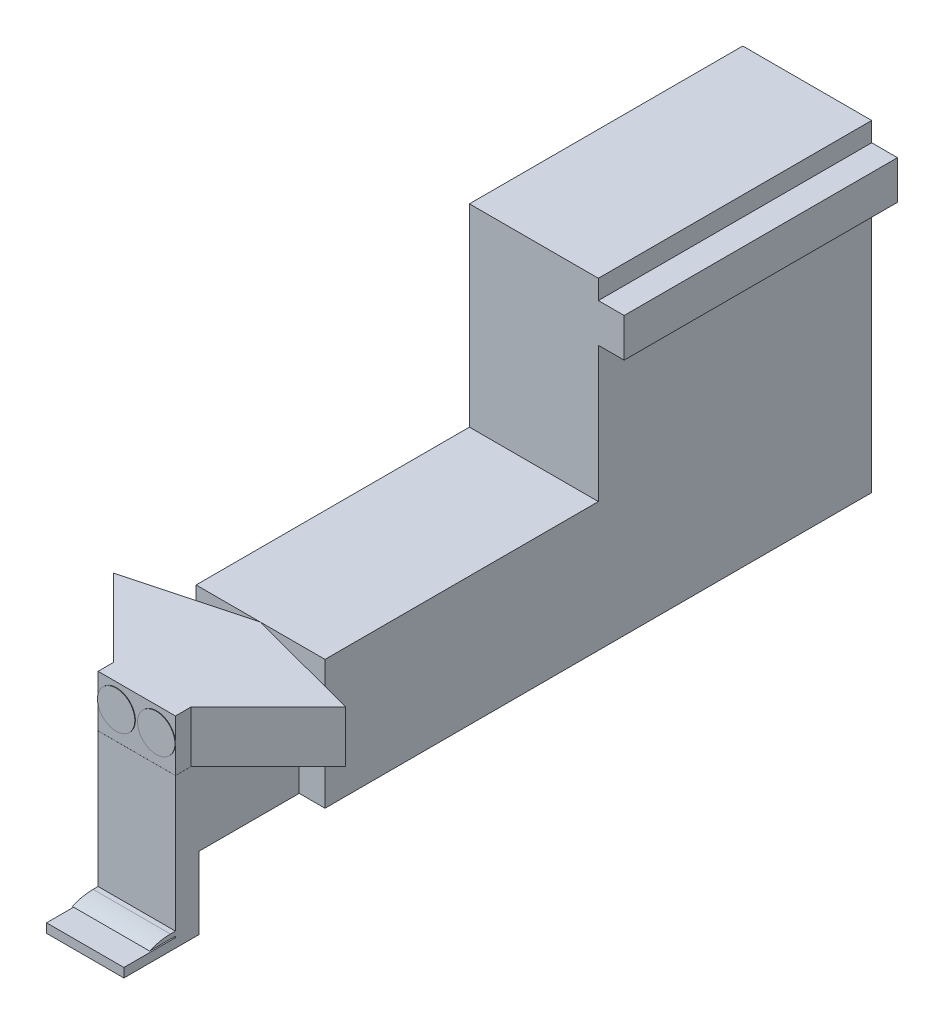
ISO-10303-21;
HEADER;
FILE_DESCRIPTION(('STEP AP214'),'2;1');
FILE_NAME('part.step','',(''),(''),'','','');
FILE_SCHEMA(('AUTOMOTIVE_DESIGN { 1 0 10303 214 1 1 1 1 }'));
ENDSEC;
DATA;
#1=APPLICATION_CONTEXT('core data for automotive mechanical design processes');
#2=APPLICATION_PROTOCOL_DEFINITION('international standard','automotive_design',2000,#1);
#3=PRODUCT_CONTEXT('',#1,'mechanical');
#4=PRODUCT('Part','Part','',(#3));
#5=PRODUCT_RELATED_PRODUCT_CATEGORY('part','',(#4));
#6=PRODUCT_DEFINITION_FORMATION('','',#4);
#7=PRODUCT_DEFINITION_CONTEXT('part definition',#1,'design');
#8=PRODUCT_DEFINITION('design','',#6,#7);
#9=PRODUCT_DEFINITION_SHAPE('','',#8);
#10=(LENGTH_UNIT() NAMED_UNIT(*) SI_UNIT(.MILLI.,.METRE.));
#11=(NAMED_UNIT(*) PLANE_ANGLE_UNIT() SI_UNIT($,.RADIAN.));
#12=(NAMED_UNIT(*) SI_UNIT($,.STERADIAN.) SOLID_ANGLE_UNIT());
#13=UNCERTAINTY_MEASURE_WITH_UNIT(LENGTH_MEASURE(1.E-05),#10,'distance_accuracy_value','');
#14=(GEOMETRIC_REPRESENTATION_CONTEXT(3) GLOBAL_UNCERTAINTY_ASSIGNED_CONTEXT((#13)) GLOBAL_UNIT_ASSIGNED_CONTEXT((#10,
#11,#12)) REPRESENTATION_CONTEXT('',''));
#15=CARTESIAN_POINT('',(0.,0.,0.));
#16=DIRECTION('',(0.,0.,1.));
#17=DIRECTION('',(1.,0.,0.));
#18=AXIS2_PLACEMENT_3D('',#15,#16,#17);
#19=CARTESIAN_POINT('',(-12.5,-40.,79.5));
#20=DIRECTION('',(0.257662650560333,0.,-0.966234939601246));
#21=DIRECTION('',(-0.966234939601246,0.,-0.257662650560333));
#22=AXIS2_PLACEMENT_3D('',#19,#20,#21);
#23=PLANE('',#22);
#24=DIRECTION('',(-0.966234939601246,0.,-0.257662650560333));
#25=VECTOR('',#24,1.);
#26=CARTESIAN_POINT('',(-12.5,-30.,79.5));
#27=LINE('',#26,#25);
#28=CARTESIAN_POINT('',(10.,-30.,85.5));
#29=VERTEX_POINT('',#28);
#30=CARTESIAN_POINT('',(-12.5,-30.,79.5));
#31=VERTEX_POINT('',#30);
#32=EDGE_CURVE('E156',#29,#31,#27,.T.);
#33=ORIENTED_EDGE('',*,*,#32,.F.);
#34=DIRECTION('',(0.,1.,0.));
#35=VECTOR('',#34,1.);
#36=CARTESIAN_POINT('',(10.,-40.,85.5));
#37=LINE('',#36,#35);
#38=CARTESIAN_POINT('',(10.,-40.,85.5));
#39=VERTEX_POINT('',#38);
#40=EDGE_CURVE('E61',#39,#29,#37,.T.);
#41=ORIENTED_EDGE('',*,*,#40,.F.);
#42=DIRECTION('',(-0.966234939601246,0.,-0.257662650560333));
#43=VECTOR('',#42,1.);
#44=CARTESIAN_POINT('',(-12.5,-40.,79.5));
#45=LINE('',#44,#43);
#46=CARTESIAN_POINT('',(-12.5,-40.,79.5));
#47=VERTEX_POINT('',#46);
#48=EDGE_CURVE('E178',#39,#47,#45,.T.);
#49=ORIENTED_EDGE('',*,*,#48,.T.);
#50=DIRECTION('',(0.,1.,0.));
#51=VECTOR('',#50,1.);
#52=CARTESIAN_POINT('',(-12.5,-40.,79.5));
#53=LINE('',#52,#51);
#54=EDGE_CURVE('E56',#47,#31,#53,.T.);
#55=ORIENTED_EDGE('',*,*,#54,.T.);
#56=EDGE_LOOP('',(#33,#41,#49,#55));
#57=FACE_BOUND('',#56,.T.);
#58=ADVANCED_FACE('F53',(#57),#23,.T.);
#59=CARTESIAN_POINT('',(10.,-40.,85.5));
#60=DIRECTION('',(0.707106781186549,0.,0.707106781186546));
#61=DIRECTION('',(0.707106781186546,0.,-0.707106781186549));
#62=AXIS2_PLACEMENT_3D('',#59,#60,#61);
#63=PLANE('',#62);
#64=DIRECTION('',(0.707106781186546,0.,-0.707106781186549));
#65=VECTOR('',#64,1.);
#66=CARTESIAN_POINT('',(10.,-30.,85.5));
#67=LINE('',#66,#65);
#68=CARTESIAN_POINT('',(-4.99999999999994,-30.,100.5));
#69=VERTEX_POINT('',#68);
#70=EDGE_CURVE('E175',#69,#29,#67,.T.);
#71=ORIENTED_EDGE('',*,*,#70,.F.);
#72=DIRECTION('',(0.,1.,0.));
#73=VECTOR('',#72,1.);
#74=CARTESIAN_POINT('',(-4.99999999999994,-40.,100.5));
#75=LINE('',#74,#73);
#76=CARTESIAN_POINT('',(-4.99999999999994,-40.,100.5));
#77=VERTEX_POINT('',#76);
#78=EDGE_CURVE('E137',#77,#69,#75,.T.);
#79=ORIENTED_EDGE('',*,*,#78,.F.);
#80=DIRECTION('',(0.707106781186546,0.,-0.707106781186549));
#81=VECTOR('',#80,1.);
#82=CARTESIAN_POINT('',(10.,-40.,85.5));
#83=LINE('',#82,#81);
#84=EDGE_CURVE('E145',#77,#39,#83,.T.);
#85=ORIENTED_EDGE('',*,*,#84,.T.);
#86=ORIENTED_EDGE('',*,*,#40,.T.);
#87=EDGE_LOOP('',(#71,#79,#85,#86));
#88=FACE_BOUND('',#87,.T.);
#89=ADVANCED_FACE('F190',(#88),#63,.T.);
#90=CARTESIAN_POINT('',(-4.99999999999994,-40.,100.5));
#91=DIRECTION('',(1.,0.,0.));
#92=DIRECTION('',(0.,0.,-1.));
#93=AXIS2_PLACEMENT_3D('',#90,#91,#92);
#94=PLANE('',#93);
#95=DIRECTION('',(0.,0.,-1.));
#96=VECTOR('',#95,1.);
#97=CARTESIAN_POINT('',(-4.99999999999994,-30.,100.5));
#98=LINE('',#97,#96);
#99=CARTESIAN_POINT('',(-4.99999999999994,-30.,103.5));
#100=VERTEX_POINT('',#99);
#101=EDGE_CURVE('E172',#100,#69,#98,.T.);
#102=ORIENTED_EDGE('',*,*,#101,.F.);
#103=DIRECTION('',(0.,1.,0.));
#104=VECTOR('',#103,1.);
#105=CARTESIAN_POINT('',(-4.99999999999994,-40.,103.5));
#106=LINE('',#105,#104);
#107=CARTESIAN_POINT('',(-4.99999999999994,-34.5921520121428,103.5));
#108=VERTEX_POINT('',#107);
#109=EDGE_CURVE('E134',#108,#100,#106,.T.);
#110=ORIENTED_EDGE('',*,*,#109,.F.);
#111=CARTESIAN_POINT('',(-4.99999999999994,-40.,103.5));
#112=VERTEX_POINT('',#111);
#113=EDGE_CURVE('E127',#112,#108,#106,.T.);
#114=ORIENTED_EDGE('',*,*,#113,.F.);
#115=DIRECTION('',(0.,0.,-1.));
#116=VECTOR('',#115,1.);
#117=CARTESIAN_POINT('',(-4.99999999999994,-40.,100.5));
#118=LINE('',#117,#116);
#119=EDGE_CURVE('E131',#112,#77,#118,.T.);
#120=ORIENTED_EDGE('',*,*,#119,.T.);
#121=ORIENTED_EDGE('',*,*,#78,.T.);
#122=EDGE_LOOP('',(#102,#110,#114,#120,#121));
#123=FACE_BOUND('',#122,.T.);
#124=ADVANCED_FACE('F130',(#123),#94,.T.);
#125=CARTESIAN_POINT('',(-20.0000000000001,-40.,103.5));
#126=DIRECTION('',(0.,0.,1.));
#127=DIRECTION('',(1.,0.,0.));
#128=AXIS2_PLACEMENT_3D('',#125,#126,#127);
#129=PLANE('',#128);
#130=CARTESIAN_POINT('',(-16.3980165160289,-34.5921520121428,103.5));
#131=DIRECTION('',(0.,0.,1.));
#132=DIRECTION('',(1.,0.,0.));
#133=AXIS2_PLACEMENT_3D('',#130,#131,#132);
#134=CIRCLE('',#133,3.625);
#135=CARTESIAN_POINT('',(-20.0000000000001,-35.,103.5));
#136=VERTEX_POINT('',#135);
#137=CARTESIAN_POINT('',(-20.0000000000001,-34.1843040242856,103.5));
#138=VERTEX_POINT('',#137);
#139=EDGE_CURVE('E12',#136,#138,#134,.T.);
#140=ORIENTED_EDGE('',*,*,#139,.F.);
#141=DIRECTION('',(0.,1.,0.));
#142=VECTOR('',#141,1.);
#143=CARTESIAN_POINT('',(-20.0000000000001,-40.,103.5));
#144=LINE('',#143,#142);
#145=CARTESIAN_POINT('',(-20.0000000000001,-40.,103.5));
#146=VERTEX_POINT('',#145);
#147=EDGE_CURVE('E148',#146,#136,#144,.T.);
#148=ORIENTED_EDGE('',*,*,#147,.F.);
#149=DIRECTION('',(1.,0.,0.));
#150=VECTOR('',#149,1.);
#151=CARTESIAN_POINT('',(-20.0000000000001,-40.,103.5));
#152=LINE('',#151,#150);
#153=EDGE_CURVE('E143',#146,#112,#152,.T.);
#154=ORIENTED_EDGE('',*,*,#153,.T.);
#155=ORIENTED_EDGE('',*,*,#113,.T.);
#156=CARTESIAN_POINT('',(-8.62499999999994,-34.5921520121428,103.5));
#157=DIRECTION('',(0.,0.,1.));
#158=DIRECTION('',(1.,0.,0.));
#159=AXIS2_PLACEMENT_3D('',#156,#157,#158);
#160=CIRCLE('',#159,3.625);
#161=EDGE_CURVE('E194',#108,#108,#160,.T.);
#162=ORIENTED_EDGE('',*,*,#161,.F.);
#163=ORIENTED_EDGE('',*,*,#109,.T.);
#164=DIRECTION('',(1.,0.,0.));
#165=VECTOR('',#164,1.);
#166=CARTESIAN_POINT('',(-20.0000000000001,-30.,103.5));
#167=LINE('',#166,#165);
#168=CARTESIAN_POINT('',(-20.0000000000001,-30.,103.5));
#169=VERTEX_POINT('',#168);
#170=EDGE_CURVE('E169',#169,#100,#167,.T.);
#171=ORIENTED_EDGE('',*,*,#170,.F.);
#172=EDGE_CURVE('E183',#138,#169,#144,.T.);
#173=ORIENTED_EDGE('',*,*,#172,.F.);
#174=EDGE_LOOP('',(#140,#148,#154,#155,#162,#163,#171,#173));
#175=FACE_BOUND('',#174,.T.);
#176=ADVANCED_FACE('F147',(#175),#129,.T.);
#177=CARTESIAN_POINT('',(-20.0000000000001,-40.,100.5));
#178=DIRECTION('',(-1.,0.,0.));
#179=DIRECTION('',(0.,0.,1.));
#180=AXIS2_PLACEMENT_3D('',#177,#178,#179);
#181=PLANE('',#180);
#182=DIRECTION('',(0.,0.,1.));
#183=VECTOR('',#182,1.);
#184=CARTESIAN_POINT('',(-20.0000000000001,-30.,100.5));
#185=LINE('',#184,#183);
#186=CARTESIAN_POINT('',(-20.0000000000001,-30.,100.5));
#187=VERTEX_POINT('',#186);
#188=EDGE_CURVE('E166',#187,#169,#185,.T.);
#189=ORIENTED_EDGE('',*,*,#188,.F.);
#190=DIRECTION('',(0.,1.,0.));
#191=VECTOR('',#190,1.);
#192=CARTESIAN_POINT('',(-20.0000000000001,-40.,100.5));
#193=LINE('',#192,#191);
#194=CARTESIAN_POINT('',(-20.0000000000001,-40.,100.5));
#195=VERTEX_POINT('',#194);
#196=EDGE_CURVE('E184',#195,#187,#193,.T.);
#197=ORIENTED_EDGE('',*,*,#196,.F.);
#198=DIRECTION('',(0.,0.,1.));
#199=VECTOR('',#198,1.);
#200=CARTESIAN_POINT('',(-20.0000000000001,-40.,100.5));
#201=LINE('',#200,#199);
#202=EDGE_CURVE('E149',#195,#146,#201,.T.);
#203=ORIENTED_EDGE('',*,*,#202,.T.);
#204=ORIENTED_EDGE('',*,*,#147,.T.);
#205=EDGE_CURVE('E182',#136,#138,#144,.T.);
#206=ORIENTED_EDGE('',*,*,#205,.T.);
#207=ORIENTED_EDGE('',*,*,#172,.T.);
#208=EDGE_LOOP('',(#189,#197,#203,#204,#206,#207));
#209=FACE_BOUND('',#208,.T.);
#210=ADVANCED_FACE('F208',(#209),#181,.T.);
#211=CARTESIAN_POINT('',(-35.,-40.,85.5));
#212=DIRECTION('',(-0.707106781186549,0.,0.707106781186546));
#213=DIRECTION('',(0.707106781186546,0.,0.707106781186549));
#214=AXIS2_PLACEMENT_3D('',#211,#212,#213);
#215=PLANE('',#214);
#216=DIRECTION('',(0.707106781186546,0.,0.707106781186549));
#217=VECTOR('',#216,1.);
#218=CARTESIAN_POINT('',(-35.,-30.,85.5));
#219=LINE('',#218,#217);
#220=CARTESIAN_POINT('',(-35.,-30.,85.5));
#221=VERTEX_POINT('',#220);
#222=EDGE_CURVE('E163',#221,#187,#219,.T.);
#223=ORIENTED_EDGE('',*,*,#222,.F.);
#224=DIRECTION('',(0.,1.,0.));
#225=VECTOR('',#224,1.);
#226=CARTESIAN_POINT('',(-35.,-40.,85.5));
#227=LINE('',#226,#225);
#228=CARTESIAN_POINT('',(-35.,-40.,85.5));
#229=VERTEX_POINT('',#228);
#230=EDGE_CURVE('E185',#229,#221,#227,.T.);
#231=ORIENTED_EDGE('',*,*,#230,.F.);
#232=DIRECTION('',(0.707106781186546,0.,0.707106781186549));
#233=VECTOR('',#232,1.);
#234=CARTESIAN_POINT('',(-35.,-40.,85.5));
#235=LINE('',#234,#233);
#236=EDGE_CURVE('E151',#229,#195,#235,.T.);
#237=ORIENTED_EDGE('',*,*,#236,.T.);
#238=ORIENTED_EDGE('',*,*,#196,.T.);
#239=EDGE_LOOP('',(#223,#231,#237,#238));
#240=FACE_BOUND('',#239,.T.);
#241=ADVANCED_FACE('F206',(#240),#215,.T.);
#242=CARTESIAN_POINT('',(-12.5,-40.,79.5));
#243=DIRECTION('',(-0.257662650560333,0.,-0.966234939601246));
#244=DIRECTION('',(-0.966234939601246,0.,0.257662650560333));
#245=AXIS2_PLACEMENT_3D('',#242,#243,#244);
#246=PLANE('',#245);
#247=DIRECTION('',(-0.966234939601246,0.,0.257662650560333));
#248=VECTOR('',#247,1.);
#249=CARTESIAN_POINT('',(-12.5,-30.,79.5));
#250=LINE('',#249,#248);
#251=EDGE_CURVE('E159',#31,#221,#250,.T.);
#252=ORIENTED_EDGE('',*,*,#251,.F.);
#253=ORIENTED_EDGE('',*,*,#54,.F.);
#254=DIRECTION('',(-0.966234939601246,0.,0.257662650560333));
#255=VECTOR('',#254,1.);
#256=CARTESIAN_POINT('',(-12.5,-40.,79.5));
#257=LINE('',#256,#255);
#258=EDGE_CURVE('E202',#47,#229,#257,.T.);
#259=ORIENTED_EDGE('',*,*,#258,.T.);
#260=ORIENTED_EDGE('',*,*,#230,.T.);
#261=EDGE_LOOP('',(#252,#253,#259,#260));
#262=FACE_BOUND('',#261,.T.);
#263=ADVANCED_FACE('F187',(#262),#246,.T.);
#264=CARTESIAN_POINT('',(0.,-40.,0.));
#265=DIRECTION('',(0.,-1.,0.));
#266=DIRECTION('',(0.,0.,-1.));
#267=AXIS2_PLACEMENT_3D('',#264,#265,#266);
#268=PLANE('',#267);
#269=ORIENTED_EDGE('',*,*,#48,.F.);
#270=ORIENTED_EDGE('',*,*,#84,.F.);
#271=ORIENTED_EDGE('',*,*,#119,.F.);
#272=ORIENTED_EDGE('',*,*,#153,.F.);
#273=ORIENTED_EDGE('',*,*,#202,.F.);
#274=ORIENTED_EDGE('',*,*,#236,.F.);
#275=ORIENTED_EDGE('',*,*,#258,.F.);
#276=EDGE_LOOP('',(#269,#270,#271,#272,#273,#274,#275));
#277=FACE_BOUND('',#276,.T.);
#278=ADVANCED_FACE('F141',(#277),#268,.T.);
#279=CARTESIAN_POINT('',(0.,-30.,0.));
#280=DIRECTION('',(0.,-1.,0.));
#281=DIRECTION('',(0.,0.,-1.));
#282=AXIS2_PLACEMENT_3D('',#279,#280,#281);
#283=PLANE('',#282);
#284=ORIENTED_EDGE('',*,*,#32,.T.);
#285=ORIENTED_EDGE('',*,*,#251,.T.);
#286=ORIENTED_EDGE('',*,*,#222,.T.);
#287=ORIENTED_EDGE('',*,*,#188,.T.);
#288=ORIENTED_EDGE('',*,*,#170,.T.);
#289=ORIENTED_EDGE('',*,*,#101,.T.);
#290=ORIENTED_EDGE('',*,*,#70,.T.);
#291=EDGE_LOOP('',(#284,#285,#286,#287,#288,#289,#290));
#292=FACE_BOUND('',#291,.T.);
#293=ADVANCED_FACE('F189',(#292),#283,.F.);
#294=CARTESIAN_POINT('',(-8.62499999999994,-34.5921520121428,103.6));
#295=DIRECTION('',(0.,0.,-1.));
#296=DIRECTION('',(-1.,0.,0.));
#297=AXIS2_PLACEMENT_3D('',#294,#295,#296);
#298=CYLINDRICAL_SURFACE('',#297,3.625);
#299=CARTESIAN_POINT('',(-8.62499999999994,-34.5921520121428,103.6));
#300=DIRECTION('',(0.,0.,1.));
#301=DIRECTION('',(1.,0.,0.));
#302=AXIS2_PLACEMENT_3D('',#299,#300,#301);
#303=CIRCLE('',#302,3.625);
#304=CARTESIAN_POINT('',(-4.99999999999994,-34.5921520121428,103.6));
#305=VERTEX_POINT('',#304);
#306=EDGE_CURVE('E196',#305,#305,#303,.T.);
#307=ORIENTED_EDGE('',*,*,#306,.F.);
#308=EDGE_LOOP('',(#307));
#309=FACE_BOUND('',#308,.T.);
#310=ORIENTED_EDGE('',*,*,#161,.T.);
#311=EDGE_LOOP('',(#310));
#312=FACE_BOUND('',#311,.T.);
#313=ADVANCED_FACE('F231',(#309,#312),#298,.T.);
#314=CARTESIAN_POINT('',(-8.62499999999994,-34.5921520121428,103.6));
#315=DIRECTION('',(0.,0.,1.));
#316=DIRECTION('',(1.,0.,0.));
#317=AXIS2_PLACEMENT_3D('',#314,#315,#316);
#318=PLANE('',#317);
#319=ORIENTED_EDGE('',*,*,#306,.T.);
#320=EDGE_LOOP('',(#319));
#321=FACE_BOUND('',#320,.T.);
#322=ADVANCED_FACE('F224',(#321),#318,.T.);
#323=CARTESIAN_POINT('',(-16.3980165160289,-34.5921520121428,103.6));
#324=DIRECTION('',(0.,0.,-1.));
#325=DIRECTION('',(-1.,0.,0.));
#326=AXIS2_PLACEMENT_3D('',#323,#324,#325);
#327=CYLINDRICAL_SURFACE('',#326,3.625);
#328=CARTESIAN_POINT('',(-16.3980165160289,-34.5921520121428,103.6));
#329=DIRECTION('',(0.,0.,1.));
#330=DIRECTION('',(1.,0.,0.));
#331=AXIS2_PLACEMENT_3D('',#328,#329,#330);
#332=CIRCLE('',#331,3.625);
#333=CARTESIAN_POINT('',(-12.7730165160289,-34.5921520121428,103.6));
#334=VERTEX_POINT('',#333);
#335=EDGE_CURVE('E160',#334,#334,#332,.T.);
#336=ORIENTED_EDGE('',*,*,#335,.F.);
#337=EDGE_LOOP('',(#336));
#338=FACE_BOUND('',#337,.T.);
#339=EDGE_CURVE('E63',#138,#136,#134,.T.);
#340=ORIENTED_EDGE('',*,*,#339,.T.);
#341=ORIENTED_EDGE('',*,*,#139,.T.);
#342=EDGE_LOOP('',(#340,#341));
#343=FACE_BOUND('',#342,.T.);
#344=ADVANCED_FACE('F216',(#338,#343),#327,.T.);
#345=CARTESIAN_POINT('',(-16.3980165160289,-34.5921520121428,103.6));
#346=DIRECTION('',(0.,0.,1.));
#347=DIRECTION('',(1.,0.,0.));
#348=AXIS2_PLACEMENT_3D('',#345,#346,#347);
#349=PLANE('',#348);
#350=ORIENTED_EDGE('',*,*,#335,.T.);
#351=EDGE_LOOP('',(#350));
#352=FACE_BOUND('',#351,.T.);
#353=ADVANCED_FACE('F221',(#352),#349,.T.);
#354=CARTESIAN_POINT('',(-16.3980165160289,-34.5921520121428,103.5));
#355=DIRECTION('',(0.,0.,1.));
#356=DIRECTION('',(1.,0.,0.));
#357=AXIS2_PLACEMENT_3D('',#354,#355,#356);
#358=PLANE('',#357);
#359=ORIENTED_EDGE('',*,*,#205,.F.);
#360=ORIENTED_EDGE('',*,*,#339,.F.);
#361=EDGE_LOOP('',(#359,#360));
#362=FACE_BOUND('',#361,.T.);
#363=ADVANCED_FACE('F214',(#362),#358,.F.);
#364=CLOSED_SHELL('',(#58,#89,#124,#176,#210,#241,#263,#278,#293,#313,#322,#344,#353,#363));
#365=MANIFOLD_SOLID_BREP('B2',#364);
#366=CARTESIAN_POINT('',(-25.,-55.,26.5));
#367=DIRECTION('',(0.,1.,0.));
#368=DIRECTION('',(0.,0.,1.));
#369=AXIS2_PLACEMENT_3D('',#366,#367,#368);
#370=PLANE('',#369);
#371=DIRECTION('',(1.,0.,0.));
#372=VECTOR('',#371,1.);
#373=CARTESIAN_POINT('',(-40.2277037747739,-55.,98.9));
#374=LINE('',#373,#372);
#375=CARTESIAN_POINT('',(-20.0000000000001,-55.,98.9));
#376=VERTEX_POINT('',#375);
#377=CARTESIAN_POINT('',(-4.99999999999994,-55.,98.9));
#378=VERTEX_POINT('',#377);
#379=EDGE_CURVE('E510',#376,#378,#374,.T.);
#380=ORIENTED_EDGE('',*,*,#379,.F.);
#381=DIRECTION('',(0.,0.,-1.));
#382=VECTOR('',#381,1.);
#383=CARTESIAN_POINT('',(-20.0000000000001,-55.,79.5));
#384=LINE('',#383,#382);
#385=CARTESIAN_POINT('',(-20.0000000000001,-55.,79.5));
#386=VERTEX_POINT('',#385);
#387=EDGE_CURVE('E518',#376,#386,#384,.T.);
#388=ORIENTED_EDGE('',*,*,#387,.T.);
#389=DIRECTION('',(1.,0.,0.));
#390=VECTOR('',#389,1.);
#391=CARTESIAN_POINT('',(-25.,-55.,79.5));
#392=LINE('',#391,#390);
#393=CARTESIAN_POINT('',(-25.,-55.,79.5));
#394=VERTEX_POINT('',#393);
#395=EDGE_CURVE('E608',#394,#386,#392,.T.);
#396=ORIENTED_EDGE('',*,*,#395,.F.);
#397=DIRECTION('',(0.,0.,-1.));
#398=VECTOR('',#397,1.);
#399=CARTESIAN_POINT('',(-25.,-55.,26.5));
#400=LINE('',#399,#398);
#401=CARTESIAN_POINT('',(-25.,-55.,-26.5));
#402=VERTEX_POINT('',#401);
#403=EDGE_CURVE('E657',#394,#402,#400,.T.);
#404=ORIENTED_EDGE('',*,*,#403,.T.);
#405=DIRECTION('',(1.,0.,0.));
#406=VECTOR('',#405,1.);
#407=CARTESIAN_POINT('',(-25.,-55.,-26.5));
#408=LINE('',#407,#406);
#409=CARTESIAN_POINT('',(0.,-55.,-26.5));
#410=VERTEX_POINT('',#409);
#411=EDGE_CURVE('E627',#402,#410,#408,.T.);
#412=ORIENTED_EDGE('',*,*,#411,.T.);
#413=DIRECTION('',(0.,0.,-1.));
#414=VECTOR('',#413,1.);
#415=CARTESIAN_POINT('',(0.,-55.,26.5));
#416=LINE('',#415,#414);
#417=CARTESIAN_POINT('',(0.,-55.,79.5));
#418=VERTEX_POINT('',#417);
#419=EDGE_CURVE('E639',#418,#410,#416,.T.);
#420=ORIENTED_EDGE('',*,*,#419,.F.);
#421=CARTESIAN_POINT('',(-4.99999999999994,-55.,79.5));
#422=VERTEX_POINT('',#421);
#423=EDGE_CURVE('E513',#422,#418,#392,.T.);
#424=ORIENTED_EDGE('',*,*,#423,.F.);
#425=DIRECTION('',(0.,0.,1.));
#426=VECTOR('',#425,1.);
#427=CARTESIAN_POINT('',(-4.99999999999994,-55.,79.5));
#428=LINE('',#427,#426);
#429=EDGE_CURVE('E508',#422,#378,#428,.T.);
#430=ORIENTED_EDGE('',*,*,#429,.T.);
#431=EDGE_LOOP('',(#380,#388,#396,#404,#412,#420,#424,#430));
#432=FACE_BOUND('',#431,.T.);
#433=ADVANCED_FACE('F361',(#432),#370,.F.);
#434=CARTESIAN_POINT('',(0.,-55.,26.5));
#435=DIRECTION('',(-1.,0.,0.));
#436=DIRECTION('',(0.,-1.,0.));
#437=AXIS2_PLACEMENT_3D('',#434,#435,#436);
#438=PLANE('',#437);
#439=DIRECTION('',(0.,1.,0.));
#440=VECTOR('',#439,1.);
#441=CARTESIAN_POINT('',(0.,-55.,-26.5));
#442=LINE('',#441,#440);
#443=CARTESIAN_POINT('',(0.,-3.75,-26.5));
#444=VERTEX_POINT('',#443);
#445=EDGE_CURVE('E623',#410,#444,#442,.T.);
#446=ORIENTED_EDGE('',*,*,#445,.T.);
#447=DIRECTION('',(0.,0.,-1.));
#448=VECTOR('',#447,1.);
#449=CARTESIAN_POINT('',(0.,-3.75,26.5));
#450=LINE('',#449,#448);
#451=CARTESIAN_POINT('',(0.,-3.75,26.5));
#452=VERTEX_POINT('',#451);
#453=EDGE_CURVE('E675',#452,#444,#450,.T.);
#454=ORIENTED_EDGE('',*,*,#453,.F.);
#455=DIRECTION('',(0.,1.,0.));
#456=VECTOR('',#455,1.);
#457=CARTESIAN_POINT('',(0.,-55.,26.5));
#458=LINE('',#457,#456);
#459=CARTESIAN_POINT('',(0.,-30.,26.5));
#460=VERTEX_POINT('',#459);
#461=EDGE_CURVE('E624',#460,#452,#458,.T.);
#462=ORIENTED_EDGE('',*,*,#461,.F.);
#463=DIRECTION('',(0.,0.,-1.));
#464=VECTOR('',#463,1.);
#465=CARTESIAN_POINT('',(0.,-30.,79.5));
#466=LINE('',#465,#464);
#467=CARTESIAN_POINT('',(0.,-30.,79.5));
#468=VERTEX_POINT('',#467);
#469=EDGE_CURVE('E620',#468,#460,#466,.T.);
#470=ORIENTED_EDGE('',*,*,#469,.F.);
#471=DIRECTION('',(0.,1.,0.));
#472=VECTOR('',#471,1.);
#473=CARTESIAN_POINT('',(0.,-30.,79.5));
#474=LINE('',#473,#472);
#475=EDGE_CURVE('E611',#418,#468,#474,.T.);
#476=ORIENTED_EDGE('',*,*,#475,.F.);
#477=ORIENTED_EDGE('',*,*,#419,.T.);
#478=EDGE_LOOP('',(#446,#454,#462,#470,#476,#477));
#479=FACE_BOUND('',#478,.T.);
#480=ADVANCED_FACE('F717',(#479),#438,.F.);
#481=CARTESIAN_POINT('',(5.,-3.75,26.5));
#482=DIRECTION('',(0.,1.,0.));
#483=DIRECTION('',(-1.,0.,0.));
#484=AXIS2_PLACEMENT_3D('',#481,#482,#483);
#485=PLANE('',#484);
#486=DIRECTION('',(1.,0.,0.));
#487=VECTOR('',#486,1.);
#488=CARTESIAN_POINT('',(5.,-3.75,-26.5));
#489=LINE('',#488,#487);
#490=CARTESIAN_POINT('',(5.,-3.75,-26.5));
#491=VERTEX_POINT('',#490);
#492=EDGE_CURVE('E642',#444,#491,#489,.T.);
#493=ORIENTED_EDGE('',*,*,#492,.T.);
#494=DIRECTION('',(0.,0.,-1.));
#495=VECTOR('',#494,1.);
#496=CARTESIAN_POINT('',(5.,-3.75,26.5));
#497=LINE('',#496,#495);
#498=CARTESIAN_POINT('',(5.,-3.75,26.5));
#499=VERTEX_POINT('',#498);
#500=EDGE_CURVE('E672',#499,#491,#497,.T.);
#501=ORIENTED_EDGE('',*,*,#500,.F.);
#502=DIRECTION('',(1.,0.,0.));
#503=VECTOR('',#502,1.);
#504=CARTESIAN_POINT('',(5.,-3.75,26.5));
#505=LINE('',#504,#503);
#506=EDGE_CURVE('E626',#452,#499,#505,.T.);
#507=ORIENTED_EDGE('',*,*,#506,.F.);
#508=ORIENTED_EDGE('',*,*,#453,.T.);
#509=EDGE_LOOP('',(#493,#501,#507,#508));
#510=FACE_BOUND('',#509,.T.);
#511=ADVANCED_FACE('F745',(#510),#485,.F.);
#512=CARTESIAN_POINT('',(5.,3.75,26.5));
#513=DIRECTION('',(-1.,0.,0.));
#514=DIRECTION('',(0.,0.,1.));
#515=AXIS2_PLACEMENT_3D('',#512,#513,#514);
#516=PLANE('',#515);
#517=DIRECTION('',(0.,1.,0.));
#518=VECTOR('',#517,1.);
#519=CARTESIAN_POINT('',(5.,3.75,-26.5));
#520=LINE('',#519,#518);
#521=CARTESIAN_POINT('',(5.,3.75,-26.5));
#522=VERTEX_POINT('',#521);
#523=EDGE_CURVE('E644',#491,#522,#520,.T.);
#524=ORIENTED_EDGE('',*,*,#523,.T.);
#525=DIRECTION('',(0.,0.,-1.));
#526=VECTOR('',#525,1.);
#527=CARTESIAN_POINT('',(5.,3.75,26.5));
#528=LINE('',#527,#526);
#529=CARTESIAN_POINT('',(5.,3.75,26.5));
#530=VERTEX_POINT('',#529);
#531=EDGE_CURVE('E669',#530,#522,#528,.T.);
#532=ORIENTED_EDGE('',*,*,#531,.F.);
#533=DIRECTION('',(0.,1.,0.));
#534=VECTOR('',#533,1.);
#535=CARTESIAN_POINT('',(5.,3.75,26.5));
#536=LINE('',#535,#534);
#537=EDGE_CURVE('E629',#499,#530,#536,.T.);
#538=ORIENTED_EDGE('',*,*,#537,.F.);
#539=ORIENTED_EDGE('',*,*,#500,.T.);
#540=EDGE_LOOP('',(#524,#532,#538,#539));
#541=FACE_BOUND('',#540,.T.);
#542=ADVANCED_FACE('F742',(#541),#516,.F.);
#543=CARTESIAN_POINT('',(5.,3.75,26.5));
#544=DIRECTION('',(0.,-1.,0.));
#545=DIRECTION('',(1.,0.,0.));
#546=AXIS2_PLACEMENT_3D('',#543,#544,#545);
#547=PLANE('',#546);
#548=DIRECTION('',(-1.,0.,0.));
#549=VECTOR('',#548,1.);
#550=CARTESIAN_POINT('',(5.,3.75,-26.5));
#551=LINE('',#550,#549);
#552=CARTESIAN_POINT('',(0.,3.75,-26.5));
#553=VERTEX_POINT('',#552);
#554=EDGE_CURVE('E646',#522,#553,#551,.T.);
#555=ORIENTED_EDGE('',*,*,#554,.T.);
#556=DIRECTION('',(0.,0.,-1.));
#557=VECTOR('',#556,1.);
#558=CARTESIAN_POINT('',(0.,3.75,26.5));
#559=LINE('',#558,#557);
#560=CARTESIAN_POINT('',(0.,3.75,26.5));
#561=VERTEX_POINT('',#560);
#562=EDGE_CURVE('E666',#561,#553,#559,.T.);
#563=ORIENTED_EDGE('',*,*,#562,.F.);
#564=DIRECTION('',(-1.,0.,0.));
#565=VECTOR('',#564,1.);
#566=CARTESIAN_POINT('',(5.,3.75,26.5));
#567=LINE('',#566,#565);
#568=EDGE_CURVE('E631',#530,#561,#567,.T.);
#569=ORIENTED_EDGE('',*,*,#568,.F.);
#570=ORIENTED_EDGE('',*,*,#531,.T.);
#571=EDGE_LOOP('',(#555,#563,#569,#570));
#572=FACE_BOUND('',#571,.T.);
#573=ADVANCED_FACE('F737',(#572),#547,.F.);
#574=CARTESIAN_POINT('',(0.,3.75,26.5));
#575=DIRECTION('',(-1.,0.,0.));
#576=DIRECTION('',(0.,-1.,0.));
#577=AXIS2_PLACEMENT_3D('',#574,#575,#576);
#578=PLANE('',#577);
#579=DIRECTION('',(0.,1.,0.));
#580=VECTOR('',#579,1.);
#581=CARTESIAN_POINT('',(0.,3.75,-26.5));
#582=LINE('',#581,#580);
#583=CARTESIAN_POINT('',(0.,7.5,-26.5));
#584=VERTEX_POINT('',#583);
#585=EDGE_CURVE('E648',#553,#584,#582,.T.);
#586=ORIENTED_EDGE('',*,*,#585,.T.);
#587=DIRECTION('',(0.,0.,-1.));
#588=VECTOR('',#587,1.);
#589=CARTESIAN_POINT('',(0.,7.5,26.5));
#590=LINE('',#589,#588);
#591=CARTESIAN_POINT('',(0.,7.5,26.5));
#592=VERTEX_POINT('',#591);
#593=EDGE_CURVE('E663',#592,#584,#590,.T.);
#594=ORIENTED_EDGE('',*,*,#593,.F.);
#595=DIRECTION('',(0.,1.,0.));
#596=VECTOR('',#595,1.);
#597=CARTESIAN_POINT('',(0.,3.75,26.5));
#598=LINE('',#597,#596);
#599=EDGE_CURVE('E633',#561,#592,#598,.T.);
#600=ORIENTED_EDGE('',*,*,#599,.F.);
#601=ORIENTED_EDGE('',*,*,#562,.T.);
#602=EDGE_LOOP('',(#586,#594,#600,#601));
#603=FACE_BOUND('',#602,.T.);
#604=ADVANCED_FACE('F732',(#603),#578,.F.);
#605=CARTESIAN_POINT('',(-25.,7.5,26.5));
#606=DIRECTION('',(0.,-1.,0.));
#607=DIRECTION('',(0.,0.,-1.));
#608=AXIS2_PLACEMENT_3D('',#605,#606,#607);
#609=PLANE('',#608);
#610=DIRECTION('',(-1.,0.,0.));
#611=VECTOR('',#610,1.);
#612=CARTESIAN_POINT('',(-25.,7.5,-26.5));
#613=LINE('',#612,#611);
#614=CARTESIAN_POINT('',(-25.,7.5,-26.5));
#615=VERTEX_POINT('',#614);
#616=EDGE_CURVE('E650',#584,#615,#613,.T.);
#617=ORIENTED_EDGE('',*,*,#616,.T.);
#618=DIRECTION('',(0.,0.,-1.));
#619=VECTOR('',#618,1.);
#620=CARTESIAN_POINT('',(-25.,7.5,26.5));
#621=LINE('',#620,#619);
#622=CARTESIAN_POINT('',(-25.,7.5,26.5));
#623=VERTEX_POINT('',#622);
#624=EDGE_CURVE('E660',#623,#615,#621,.T.);
#625=ORIENTED_EDGE('',*,*,#624,.F.);
#626=DIRECTION('',(-1.,0.,0.));
#627=VECTOR('',#626,1.);
#628=CARTESIAN_POINT('',(-25.,7.5,26.5));
#629=LINE('',#628,#627);
#630=EDGE_CURVE('E635',#592,#623,#629,.T.);
#631=ORIENTED_EDGE('',*,*,#630,.F.);
#632=ORIENTED_EDGE('',*,*,#593,.T.);
#633=EDGE_LOOP('',(#617,#625,#631,#632));
#634=FACE_BOUND('',#633,.T.);
#635=ADVANCED_FACE('F730',(#634),#609,.F.);
#636=CARTESIAN_POINT('',(-25.,-55.,26.5));
#637=DIRECTION('',(1.,0.,0.));
#638=DIRECTION('',(0.,0.,-1.));
#639=AXIS2_PLACEMENT_3D('',#636,#637,#638);
#640=PLANE('',#639);
#641=DIRECTION('',(0.,-1.,0.));
#642=VECTOR('',#641,1.);
#643=CARTESIAN_POINT('',(-25.,-55.,-26.5));
#644=LINE('',#643,#642);
#645=EDGE_CURVE('E652',#615,#402,#644,.T.);
#646=ORIENTED_EDGE('',*,*,#645,.T.);
#647=ORIENTED_EDGE('',*,*,#403,.F.);
#648=DIRECTION('',(0.,-1.,0.));
#649=VECTOR('',#648,1.);
#650=CARTESIAN_POINT('',(-25.,-30.,79.5));
#651=LINE('',#650,#649);
#652=CARTESIAN_POINT('',(-25.,-30.,79.5));
#653=VERTEX_POINT('',#652);
#654=EDGE_CURVE('E605',#653,#394,#651,.T.);
#655=ORIENTED_EDGE('',*,*,#654,.F.);
#656=DIRECTION('',(0.,0.,-1.));
#657=VECTOR('',#656,1.);
#658=CARTESIAN_POINT('',(-25.,-30.,79.5));
#659=LINE('',#658,#657);
#660=CARTESIAN_POINT('',(-25.,-30.,26.5));
#661=VERTEX_POINT('',#660);
#662=EDGE_CURVE('E615',#653,#661,#659,.T.);
#663=ORIENTED_EDGE('',*,*,#662,.T.);
#664=DIRECTION('',(0.,-1.,0.));
#665=VECTOR('',#664,1.);
#666=CARTESIAN_POINT('',(-25.,-55.,26.5));
#667=LINE('',#666,#665);
#668=EDGE_CURVE('E637',#623,#661,#667,.T.);
#669=ORIENTED_EDGE('',*,*,#668,.F.);
#670=ORIENTED_EDGE('',*,*,#624,.T.);
#671=EDGE_LOOP('',(#646,#647,#655,#663,#669,#670));
#672=FACE_BOUND('',#671,.T.);
#673=ADVANCED_FACE('F706',(#672),#640,.F.);
#674=CARTESIAN_POINT('',(0.,0.,26.5));
#675=DIRECTION('',(0.,0.,1.));
#676=DIRECTION('',(1.,0.,0.));
#677=AXIS2_PLACEMENT_3D('',#674,#675,#676);
#678=PLANE('',#677);
#679=DIRECTION('',(-1.,0.,0.));
#680=VECTOR('',#679,1.);
#681=CARTESIAN_POINT('',(-25.,-30.,26.5));
#682=LINE('',#681,#680);
#683=EDGE_CURVE('E598',#460,#661,#682,.T.);
#684=ORIENTED_EDGE('',*,*,#683,.F.);
#685=ORIENTED_EDGE('',*,*,#461,.T.);
#686=ORIENTED_EDGE('',*,*,#506,.T.);
#687=ORIENTED_EDGE('',*,*,#537,.T.);
#688=ORIENTED_EDGE('',*,*,#568,.T.);
#689=ORIENTED_EDGE('',*,*,#599,.T.);
#690=ORIENTED_EDGE('',*,*,#630,.T.);
#691=ORIENTED_EDGE('',*,*,#668,.T.);
#692=EDGE_LOOP('',(#684,#685,#686,#687,#688,#689,#690,#691));
#693=FACE_BOUND('',#692,.T.);
#694=ADVANCED_FACE('F724',(#693),#678,.T.);
#695=CARTESIAN_POINT('',(0.,0.,-26.5));
#696=DIRECTION('',(0.,0.,1.));
#697=DIRECTION('',(1.,0.,0.));
#698=AXIS2_PLACEMENT_3D('',#695,#696,#697);
#699=PLANE('',#698);
#700=ORIENTED_EDGE('',*,*,#445,.F.);
#701=ORIENTED_EDGE('',*,*,#411,.F.);
#702=ORIENTED_EDGE('',*,*,#645,.F.);
#703=ORIENTED_EDGE('',*,*,#616,.F.);
#704=ORIENTED_EDGE('',*,*,#585,.F.);
#705=ORIENTED_EDGE('',*,*,#554,.F.);
#706=ORIENTED_EDGE('',*,*,#523,.F.);
#707=ORIENTED_EDGE('',*,*,#492,.F.);
#708=EDGE_LOOP('',(#700,#701,#702,#703,#704,#705,#706,#707));
#709=FACE_BOUND('',#708,.T.);
#710=ADVANCED_FACE('F713',(#709),#699,.F.);
#711=CARTESIAN_POINT('',(-25.,-30.,79.5));
#712=DIRECTION('',(0.,-1.,0.));
#713=DIRECTION('',(0.,0.,-1.));
#714=AXIS2_PLACEMENT_3D('',#711,#712,#713);
#715=PLANE('',#714);
#716=ORIENTED_EDGE('',*,*,#683,.T.);
#717=ORIENTED_EDGE('',*,*,#662,.F.);
#718=DIRECTION('',(-1.,0.,0.));
#719=VECTOR('',#718,1.);
#720=CARTESIAN_POINT('',(-25.,-30.,79.5));
#721=LINE('',#720,#719);
#722=EDGE_CURVE('E613',#468,#653,#721,.T.);
#723=ORIENTED_EDGE('',*,*,#722,.F.);
#724=ORIENTED_EDGE('',*,*,#469,.T.);
#725=EDGE_LOOP('',(#716,#717,#723,#724));
#726=FACE_BOUND('',#725,.T.);
#727=ADVANCED_FACE('F722',(#726),#715,.F.);
#728=CARTESIAN_POINT('',(0.,0.,79.5));
#729=DIRECTION('',(0.,0.,1.));
#730=DIRECTION('',(1.,0.,0.));
#731=AXIS2_PLACEMENT_3D('',#728,#729,#730);
#732=PLANE('',#731);
#733=DIRECTION('',(0.,-1.,0.));
#734=VECTOR('',#733,1.);
#735=CARTESIAN_POINT('',(-20.0000000000001,-40.01,79.5));
#736=LINE('',#735,#734);
#737=CARTESIAN_POINT('',(-20.0000000000001,-40.01,79.5));
#738=VERTEX_POINT('',#737);
#739=EDGE_CURVE('E594',#738,#386,#736,.T.);
#740=ORIENTED_EDGE('',*,*,#739,.F.);
#741=DIRECTION('',(1.,0.,0.));
#742=VECTOR('',#741,1.);
#743=CARTESIAN_POINT('',(-20.0000000000001,-40.01,79.5));
#744=LINE('',#743,#742);
#745=CARTESIAN_POINT('',(-4.99999999999994,-40.01,79.5));
#746=VERTEX_POINT('',#745);
#747=EDGE_CURVE('E585',#738,#746,#744,.T.);
#748=ORIENTED_EDGE('',*,*,#747,.T.);
#749=DIRECTION('',(0.,-1.,0.));
#750=VECTOR('',#749,1.);
#751=CARTESIAN_POINT('',(-4.99999999999994,-40.01,79.5));
#752=LINE('',#751,#750);
#753=EDGE_CURVE('E601',#746,#422,#752,.T.);
#754=ORIENTED_EDGE('',*,*,#753,.T.);
#755=ORIENTED_EDGE('',*,*,#423,.T.);
#756=ORIENTED_EDGE('',*,*,#475,.T.);
#757=ORIENTED_EDGE('',*,*,#722,.T.);
#758=ORIENTED_EDGE('',*,*,#654,.T.);
#759=ORIENTED_EDGE('',*,*,#395,.T.);
#760=EDGE_LOOP('',(#740,#748,#754,#755,#756,#757,#758,#759));
#761=FACE_BOUND('',#760,.T.);
#762=ADVANCED_FACE('F699',(#761),#732,.T.);
#763=CARTESIAN_POINT('',(-20.0000000000001,-40.01,79.5));
#764=DIRECTION('',(-1.,0.,0.));
#765=DIRECTION('',(0.,0.,1.));
#766=AXIS2_PLACEMENT_3D('',#763,#764,#765);
#767=PLANE('',#766);
#768=DIRECTION('',(0.,0.,-1.));
#769=VECTOR('',#768,1.);
#770=CARTESIAN_POINT('',(-20.0000000000001,-66.98,103.5));
#771=LINE('',#770,#769);
#772=CARTESIAN_POINT('',(-20.0000000000001,-66.98,108.5));
#773=VERTEX_POINT('',#772);
#774=CARTESIAN_POINT('',(-20.0000000000001,-66.98,103.5));
#775=VERTEX_POINT('',#774);
#776=EDGE_CURVE('E572',#773,#775,#771,.T.);
#777=ORIENTED_EDGE('',*,*,#776,.F.);
#778=CARTESIAN_POINT('',(-20.0000000000001,-76.13,104.465461612526));
#779=DIRECTION('',(-1.,0.,0.));
#780=DIRECTION('',(0.,0.,1.));
#781=AXIS2_PLACEMENT_3D('',#778,#779,#780);
#782=CIRCLE('',#781,10.);
#783=CARTESIAN_POINT('',(-20.0000000000001,-66.13,104.465461612526));
#784=VERTEX_POINT('',#783);
#785=EDGE_CURVE('E51',#773,#784,#782,.T.);
#786=ORIENTED_EDGE('',*,*,#785,.T.);
#787=DIRECTION('',(0.,0.,1.));
#788=VECTOR('',#787,1.);
#789=CARTESIAN_POINT('',(-20.0000000000001,-66.13,103.5));
#790=LINE('',#789,#788);
#791=CARTESIAN_POINT('',(-20.0000000000001,-66.13,103.5));
#792=VERTEX_POINT('',#791);
#793=EDGE_CURVE('E535',#792,#784,#790,.T.);
#794=ORIENTED_EDGE('',*,*,#793,.F.);
#795=DIRECTION('',(0.,-1.,0.));
#796=VECTOR('',#795,1.);
#797=CARTESIAN_POINT('',(-20.0000000000001,-40.01,103.5));
#798=LINE('',#797,#796);
#799=CARTESIAN_POINT('',(-20.0000000000001,-40.01,103.5));
#800=VERTEX_POINT('',#799);
#801=EDGE_CURVE('E596',#800,#792,#798,.T.);
#802=ORIENTED_EDGE('',*,*,#801,.F.);
#803=DIRECTION('',(0.,0.,-1.));
#804=VECTOR('',#803,1.);
#805=CARTESIAN_POINT('',(-20.0000000000001,-40.01,79.5));
#806=LINE('',#805,#804);
#807=EDGE_CURVE('E517',#800,#738,#806,.T.);
#808=ORIENTED_EDGE('',*,*,#807,.T.);
#809=ORIENTED_EDGE('',*,*,#739,.T.);
#810=ORIENTED_EDGE('',*,*,#387,.F.);
#811=DIRECTION('',(0.,1.,0.));
#812=VECTOR('',#811,1.);
#813=CARTESIAN_POINT('',(-20.0000000000001,-55.,98.9));
#814=LINE('',#813,#812);
#815=CARTESIAN_POINT('',(-20.0000000000001,-69.,98.9));
#816=VERTEX_POINT('',#815);
#817=EDGE_CURVE('E527',#816,#376,#814,.T.);
#818=ORIENTED_EDGE('',*,*,#817,.F.);
#819=DIRECTION('',(0.,0.,-1.));
#820=VECTOR('',#819,1.);
#821=CARTESIAN_POINT('',(-20.0000000000001,-69.,103.5));
#822=LINE('',#821,#820);
#823=CARTESIAN_POINT('',(-20.0000000000001,-69.,113.5));
#824=VERTEX_POINT('',#823);
#825=EDGE_CURVE('E556',#824,#816,#822,.T.);
#826=ORIENTED_EDGE('',*,*,#825,.F.);
#827=DIRECTION('',(0.,-1.,0.));
#828=VECTOR('',#827,1.);
#829=CARTESIAN_POINT('',(-20.0000000000001,-69.,113.5));
#830=LINE('',#829,#828);
#831=CARTESIAN_POINT('',(-20.0000000000001,-67.23,113.5));
#832=VERTEX_POINT('',#831);
#833=EDGE_CURVE('E560',#832,#824,#830,.T.);
#834=ORIENTED_EDGE('',*,*,#833,.F.);
#835=DIRECTION('',(0.,0.,1.));
#836=VECTOR('',#835,1.);
#837=CARTESIAN_POINT('',(-20.0000000000001,-67.23,103.5));
#838=LINE('',#837,#836);
#839=CARTESIAN_POINT('',(-20.0000000000001,-67.23,103.5));
#840=VERTEX_POINT('',#839);
#841=EDGE_CURVE('E564',#840,#832,#838,.T.);
#842=ORIENTED_EDGE('',*,*,#841,.F.);
#843=DIRECTION('',(0.,-1.,0.));
#844=VECTOR('',#843,1.);
#845=CARTESIAN_POINT('',(-20.0000000000001,-66.98,103.5));
#846=LINE('',#845,#844);
#847=EDGE_CURVE('E568',#775,#840,#846,.T.);
#848=ORIENTED_EDGE('',*,*,#847,.F.);
#849=EDGE_LOOP('',(#777,#786,#794,#802,#808,#809,#810,#818,#826,#834,#842,#848));
#850=FACE_BOUND('',#849,.T.);
#851=ADVANCED_FACE('F689',(#850),#767,.T.);
#852=CARTESIAN_POINT('',(-20.0000000000001,-40.01,103.5));
#853=DIRECTION('',(0.,0.,1.));
#854=DIRECTION('',(1.,0.,0.));
#855=AXIS2_PLACEMENT_3D('',#852,#853,#854);
#856=PLANE('',#855);
#857=ORIENTED_EDGE('',*,*,#801,.T.);
#858=DIRECTION('',(1.,0.,0.));
#859=VECTOR('',#858,1.);
#860=CARTESIAN_POINT('',(-40.2277037747739,-66.13,103.5));
#861=LINE('',#860,#859);
#862=CARTESIAN_POINT('',(-4.99999999999994,-66.13,103.5));
#863=VERTEX_POINT('',#862);
#864=EDGE_CURVE('E528',#792,#863,#861,.T.);
#865=ORIENTED_EDGE('',*,*,#864,.T.);
#866=DIRECTION('',(0.,-1.,0.));
#867=VECTOR('',#866,1.);
#868=CARTESIAN_POINT('',(-4.99999999999994,-40.01,103.5));
#869=LINE('',#868,#867);
#870=CARTESIAN_POINT('',(-4.99999999999994,-40.01,103.5));
#871=VERTEX_POINT('',#870);
#872=EDGE_CURVE('E599',#871,#863,#869,.T.);
#873=ORIENTED_EDGE('',*,*,#872,.F.);
#874=DIRECTION('',(-1.,0.,0.));
#875=VECTOR('',#874,1.);
#876=CARTESIAN_POINT('',(-20.0000000000001,-40.01,103.5));
#877=LINE('',#876,#875);
#878=EDGE_CURVE('E591',#871,#800,#877,.T.);
#879=ORIENTED_EDGE('',*,*,#878,.T.);
#880=EDGE_LOOP('',(#857,#865,#873,#879));
#881=FACE_BOUND('',#880,.T.);
#882=ADVANCED_FACE('F697',(#881),#856,.T.);
#883=CARTESIAN_POINT('',(-4.99999999999994,-40.01,79.5));
#884=DIRECTION('',(1.,0.,0.));
#885=DIRECTION('',(0.,0.,-1.));
#886=AXIS2_PLACEMENT_3D('',#883,#884,#885);
#887=PLANE('',#886);
#888=DIRECTION('',(0.,0.,1.));
#889=VECTOR('',#888,1.);
#890=CARTESIAN_POINT('',(-4.99999999999994,-66.13,103.5));
#891=LINE('',#890,#889);
#892=CARTESIAN_POINT('',(-4.99999999999994,-66.13,104.465461612526));
#893=VERTEX_POINT('',#892);
#894=EDGE_CURVE('E552',#863,#893,#891,.T.);
#895=ORIENTED_EDGE('',*,*,#894,.T.);
#896=CARTESIAN_POINT('',(-4.99999999999994,-76.13,104.465461612526));
#897=DIRECTION('',(1.,0.,0.));
#898=DIRECTION('',(0.,0.,-1.));
#899=AXIS2_PLACEMENT_3D('',#896,#897,#898);
#900=CIRCLE('',#899,10.);
#901=CARTESIAN_POINT('',(-4.99999999999994,-66.98,108.5));
#902=VERTEX_POINT('',#901);
#903=EDGE_CURVE('E369',#893,#902,#900,.T.);
#904=ORIENTED_EDGE('',*,*,#903,.T.);
#905=DIRECTION('',(0.,0.,-1.));
#906=VECTOR('',#905,1.);
#907=CARTESIAN_POINT('',(-4.99999999999994,-66.98,103.5));
#908=LINE('',#907,#906);
#909=CARTESIAN_POINT('',(-4.99999999999994,-66.98,103.5));
#910=VERTEX_POINT('',#909);
#911=EDGE_CURVE('E549',#902,#910,#908,.T.);
#912=ORIENTED_EDGE('',*,*,#911,.T.);
#913=DIRECTION('',(0.,-1.,0.));
#914=VECTOR('',#913,1.);
#915=CARTESIAN_POINT('',(-4.99999999999994,-66.98,103.5));
#916=LINE('',#915,#914);
#917=CARTESIAN_POINT('',(-4.99999999999994,-67.23,103.5));
#918=VERTEX_POINT('',#917);
#919=EDGE_CURVE('E546',#910,#918,#916,.T.);
#920=ORIENTED_EDGE('',*,*,#919,.T.);
#921=DIRECTION('',(0.,0.,1.));
#922=VECTOR('',#921,1.);
#923=CARTESIAN_POINT('',(-4.99999999999994,-67.23,103.5));
#924=LINE('',#923,#922);
#925=CARTESIAN_POINT('',(-4.99999999999994,-67.23,113.5));
#926=VERTEX_POINT('',#925);
#927=EDGE_CURVE('E543',#918,#926,#924,.T.);
#928=ORIENTED_EDGE('',*,*,#927,.T.);
#929=DIRECTION('',(0.,-1.,0.));
#930=VECTOR('',#929,1.);
#931=CARTESIAN_POINT('',(-4.99999999999994,-69.,113.5));
#932=LINE('',#931,#930);
#933=CARTESIAN_POINT('',(-4.99999999999994,-69.,113.5));
#934=VERTEX_POINT('',#933);
#935=EDGE_CURVE('E539',#926,#934,#932,.T.);
#936=ORIENTED_EDGE('',*,*,#935,.T.);
#937=DIRECTION('',(0.,0.,-1.));
#938=VECTOR('',#937,1.);
#939=CARTESIAN_POINT('',(-4.99999999999994,-69.,103.5));
#940=LINE('',#939,#938);
#941=CARTESIAN_POINT('',(-4.99999999999994,-69.,98.9));
#942=VERTEX_POINT('',#941);
#943=EDGE_CURVE('E534',#934,#942,#940,.T.);
#944=ORIENTED_EDGE('',*,*,#943,.T.);
#945=DIRECTION('',(0.,1.,0.));
#946=VECTOR('',#945,1.);
#947=CARTESIAN_POINT('',(-4.99999999999994,-55.,98.9));
#948=LINE('',#947,#946);
#949=EDGE_CURVE('E525',#942,#378,#948,.T.);
#950=ORIENTED_EDGE('',*,*,#949,.T.);
#951=ORIENTED_EDGE('',*,*,#429,.F.);
#952=ORIENTED_EDGE('',*,*,#753,.F.);
#953=DIRECTION('',(0.,0.,1.));
#954=VECTOR('',#953,1.);
#955=CARTESIAN_POINT('',(-4.99999999999994,-40.01,79.5));
#956=LINE('',#955,#954);
#957=EDGE_CURVE('E588',#746,#871,#956,.T.);
#958=ORIENTED_EDGE('',*,*,#957,.T.);
#959=ORIENTED_EDGE('',*,*,#872,.T.);
#960=EDGE_LOOP('',(#895,#904,#912,#920,#928,#936,#944,#950,#951,#952,#958,#959));
#961=FACE_BOUND('',#960,.T.);
#962=ADVANCED_FACE('F531',(#961),#887,.T.);
#963=CARTESIAN_POINT('',(0.,-40.01,0.));
#964=DIRECTION('',(0.,1.,0.));
#965=DIRECTION('',(0.,0.,1.));
#966=AXIS2_PLACEMENT_3D('',#963,#964,#965);
#967=PLANE('',#966);
#968=ORIENTED_EDGE('',*,*,#807,.F.);
#969=ORIENTED_EDGE('',*,*,#878,.F.);
#970=ORIENTED_EDGE('',*,*,#957,.F.);
#971=ORIENTED_EDGE('',*,*,#747,.F.);
#972=EDGE_LOOP('',(#968,#969,#970,#971));
#973=FACE_BOUND('',#972,.T.);
#974=ADVANCED_FACE('F695',(#973),#967,.T.);
#975=CARTESIAN_POINT('',(-40.2277037747739,-66.13,103.5));
#976=DIRECTION('',(0.,1.,0.));
#977=DIRECTION('',(0.,0.,1.));
#978=AXIS2_PLACEMENT_3D('',#975,#976,#977);
#979=PLANE('',#978);
#980=ORIENTED_EDGE('',*,*,#793,.T.);
#981=DIRECTION('',(-1.,0.,0.));
#982=VECTOR('',#981,1.);
#983=CARTESIAN_POINT('',(-4.99999999999994,-66.13,104.465461612526));
#984=LINE('',#983,#982);
#985=EDGE_CURVE('E678',#784,#893,#984,.F.);
#986=ORIENTED_EDGE('',*,*,#985,.T.);
#987=ORIENTED_EDGE('',*,*,#894,.F.);
#988=ORIENTED_EDGE('',*,*,#864,.F.);
#989=EDGE_LOOP('',(#980,#986,#987,#988));
#990=FACE_BOUND('',#989,.T.);
#991=ADVANCED_FACE('F687',(#990),#979,.T.);
#992=CARTESIAN_POINT('',(-40.2277037747739,-66.98,103.5));
#993=DIRECTION('',(0.,-1.,0.));
#994=DIRECTION('',(0.,0.,-1.));
#995=AXIS2_PLACEMENT_3D('',#992,#993,#994);
#996=PLANE('',#995);
#997=DIRECTION('',(1.,0.,0.));
#998=VECTOR('',#997,1.);
#999=CARTESIAN_POINT('',(-40.2277037747739,-66.98,108.5));
#1000=LINE('',#999,#998);
#1001=EDGE_CURVE('E537',#773,#902,#1000,.T.);
#1002=ORIENTED_EDGE('',*,*,#1001,.F.);
#1003=ORIENTED_EDGE('',*,*,#776,.T.);
#1004=DIRECTION('',(1.,0.,0.));
#1005=VECTOR('',#1004,1.);
#1006=CARTESIAN_POINT('',(-40.2277037747739,-66.98,103.5));
#1007=LINE('',#1006,#1005);
#1008=EDGE_CURVE('E571',#775,#910,#1007,.T.);
#1009=ORIENTED_EDGE('',*,*,#1008,.T.);
#1010=ORIENTED_EDGE('',*,*,#911,.F.);
#1011=EDGE_LOOP('',(#1002,#1003,#1009,#1010));
#1012=FACE_BOUND('',#1011,.T.);
#1013=ADVANCED_FACE('F683',(#1012),#996,.T.);
#1014=CARTESIAN_POINT('',(-40.2277037747739,-66.98,103.5));
#1015=DIRECTION('',(0.,0.,1.));
#1016=DIRECTION('',(1.,0.,0.));
#1017=AXIS2_PLACEMENT_3D('',#1014,#1015,#1016);
#1018=PLANE('',#1017);
#1019=ORIENTED_EDGE('',*,*,#1008,.F.);
#1020=ORIENTED_EDGE('',*,*,#847,.T.);
#1021=DIRECTION('',(1.,0.,0.));
#1022=VECTOR('',#1021,1.);
#1023=CARTESIAN_POINT('',(-40.2277037747739,-67.23,103.5));
#1024=LINE('',#1023,#1022);
#1025=EDGE_CURVE('E567',#840,#918,#1024,.T.);
#1026=ORIENTED_EDGE('',*,*,#1025,.T.);
#1027=ORIENTED_EDGE('',*,*,#919,.F.);
#1028=EDGE_LOOP('',(#1019,#1020,#1026,#1027));
#1029=FACE_BOUND('',#1028,.T.);
#1030=ADVANCED_FACE('F884',(#1029),#1018,.T.);
#1031=CARTESIAN_POINT('',(-40.2277037747739,-67.23,103.5));
#1032=DIRECTION('',(0.,1.,0.));
#1033=DIRECTION('',(0.,0.,1.));
#1034=AXIS2_PLACEMENT_3D('',#1031,#1032,#1033);
#1035=PLANE('',#1034);
#1036=ORIENTED_EDGE('',*,*,#1025,.F.);
#1037=ORIENTED_EDGE('',*,*,#841,.T.);
#1038=DIRECTION('',(1.,0.,0.));
#1039=VECTOR('',#1038,1.);
#1040=CARTESIAN_POINT('',(-40.2277037747739,-67.23,113.5));
#1041=LINE('',#1040,#1039);
#1042=EDGE_CURVE('E563',#832,#926,#1041,.T.);
#1043=ORIENTED_EDGE('',*,*,#1042,.T.);
#1044=ORIENTED_EDGE('',*,*,#927,.F.);
#1045=EDGE_LOOP('',(#1036,#1037,#1043,#1044));
#1046=FACE_BOUND('',#1045,.T.);
#1047=ADVANCED_FACE('F893',(#1046),#1035,.T.);
#1048=CARTESIAN_POINT('',(-40.2277037747739,-69.,113.5));
#1049=DIRECTION('',(0.,0.,1.));
#1050=DIRECTION('',(1.,0.,0.));
#1051=AXIS2_PLACEMENT_3D('',#1048,#1049,#1050);
#1052=PLANE('',#1051);
#1053=ORIENTED_EDGE('',*,*,#1042,.F.);
#1054=ORIENTED_EDGE('',*,*,#833,.T.);
#1055=DIRECTION('',(1.,0.,0.));
#1056=VECTOR('',#1055,1.);
#1057=CARTESIAN_POINT('',(-40.2277037747739,-69.,113.5));
#1058=LINE('',#1057,#1056);
#1059=EDGE_CURVE('E559',#824,#934,#1058,.T.);
#1060=ORIENTED_EDGE('',*,*,#1059,.T.);
#1061=ORIENTED_EDGE('',*,*,#935,.F.);
#1062=EDGE_LOOP('',(#1053,#1054,#1060,#1061));
#1063=FACE_BOUND('',#1062,.T.);
#1064=ADVANCED_FACE('F903',(#1063),#1052,.T.);
#1065=CARTESIAN_POINT('',(-40.2277037747739,-69.,103.5));
#1066=DIRECTION('',(0.,-1.,0.));
#1067=DIRECTION('',(0.,0.,-1.));
#1068=AXIS2_PLACEMENT_3D('',#1065,#1066,#1067);
#1069=PLANE('',#1068);
#1070=ORIENTED_EDGE('',*,*,#1059,.F.);
#1071=ORIENTED_EDGE('',*,*,#825,.T.);
#1072=DIRECTION('',(1.,0.,0.));
#1073=VECTOR('',#1072,1.);
#1074=CARTESIAN_POINT('',(-40.2277037747739,-69.,98.9));
#1075=LINE('',#1074,#1073);
#1076=EDGE_CURVE('E555',#816,#942,#1075,.T.);
#1077=ORIENTED_EDGE('',*,*,#1076,.T.);
#1078=ORIENTED_EDGE('',*,*,#943,.F.);
#1079=EDGE_LOOP('',(#1070,#1071,#1077,#1078));
#1080=FACE_BOUND('',#1079,.T.);
#1081=ADVANCED_FACE('F913',(#1080),#1069,.T.);
#1082=CARTESIAN_POINT('',(-40.2277037747739,-55.,98.9));
#1083=DIRECTION('',(0.,0.,-1.));
#1084=DIRECTION('',(-1.,0.,0.));
#1085=AXIS2_PLACEMENT_3D('',#1082,#1083,#1084);
#1086=PLANE('',#1085);
#1087=ORIENTED_EDGE('',*,*,#1076,.F.);
#1088=ORIENTED_EDGE('',*,*,#817,.T.);
#1089=ORIENTED_EDGE('',*,*,#379,.T.);
#1090=ORIENTED_EDGE('',*,*,#949,.F.);
#1091=EDGE_LOOP('',(#1087,#1088,#1089,#1090));
#1092=FACE_BOUND('',#1091,.T.);
#1093=ADVANCED_FACE('F524',(#1092),#1086,.T.);
#1094=CARTESIAN_POINT('',(-40.2277037747739,-76.13,104.465461612526));
#1095=DIRECTION('',(1.,0.,0.));
#1096=DIRECTION('',(0.,0.,-1.));
#1097=AXIS2_PLACEMENT_3D('',#1094,#1095,#1096);
#1098=CYLINDRICAL_SURFACE('',#1097,10.);
#1099=ORIENTED_EDGE('',*,*,#785,.F.);
#1100=ORIENTED_EDGE('',*,*,#1001,.T.);
#1101=ORIENTED_EDGE('',*,*,#903,.F.);
#1102=ORIENTED_EDGE('',*,*,#985,.F.);
#1103=EDGE_LOOP('',(#1099,#1100,#1101,#1102));
#1104=FACE_BOUND('',#1103,.T.);
#1105=ADVANCED_FACE('F363',(#1104),#1098,.T.);
#1106=CLOSED_SHELL('',(#433,#480,#511,#542,#573,#604,#635,#673,#694,#710,#727,#762,#851,#882,
#962,#974,#991,#1013,#1030,#1047,#1064,#1081,#1093,#1105));
#1107=MANIFOLD_SOLID_BREP('B6',#1106);
#1108=ADVANCED_BREP_SHAPE_REPRESENTATION('',(#18,#365,#1107),#14);
#1109=SHAPE_DEFINITION_REPRESENTATION(#9,#1108);
ENDSEC;
END-ISO-10303-21;
